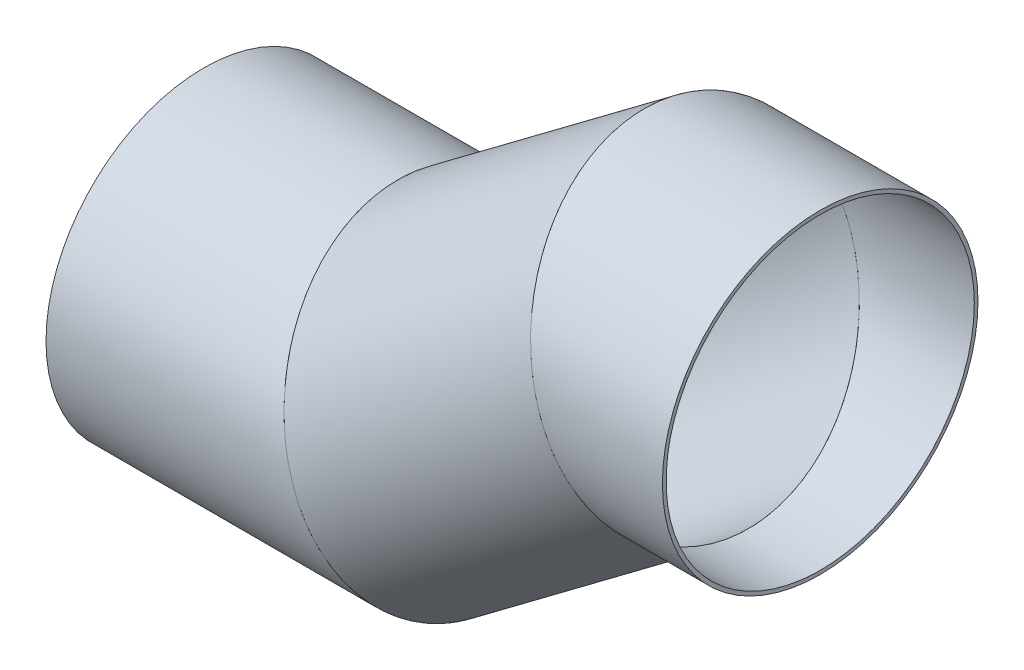
ISO-10303-21;
HEADER;
FILE_DESCRIPTION(('STEP AP214'),'2;1');
FILE_NAME('part.step','',(''),(''),'','','');
FILE_SCHEMA(('AUTOMOTIVE_DESIGN { 1 0 10303 214 1 1 1 1 }'));
ENDSEC;
DATA;
#1=APPLICATION_CONTEXT('core data for automotive mechanical design processes');
#2=APPLICATION_PROTOCOL_DEFINITION('international standard','automotive_design',2000,#1);
#3=PRODUCT_CONTEXT('',#1,'mechanical');
#4=PRODUCT('Part','Part','',(#3));
#5=PRODUCT_RELATED_PRODUCT_CATEGORY('part','',(#4));
#6=PRODUCT_DEFINITION_FORMATION('','',#4);
#7=PRODUCT_DEFINITION_CONTEXT('part definition',#1,'design');
#8=PRODUCT_DEFINITION('design','',#6,#7);
#9=PRODUCT_DEFINITION_SHAPE('','',#8);
#10=(LENGTH_UNIT() NAMED_UNIT(*) SI_UNIT(.MILLI.,.METRE.));
#11=(NAMED_UNIT(*) PLANE_ANGLE_UNIT() SI_UNIT($,.RADIAN.));
#12=(NAMED_UNIT(*) SI_UNIT($,.STERADIAN.) SOLID_ANGLE_UNIT());
#13=UNCERTAINTY_MEASURE_WITH_UNIT(LENGTH_MEASURE(1.E-05),#10,'distance_accuracy_value','');
#14=(GEOMETRIC_REPRESENTATION_CONTEXT(3) GLOBAL_UNCERTAINTY_ASSIGNED_CONTEXT((#13)) GLOBAL_UNIT_ASSIGNED_CONTEXT((#10,
#11,#12)) REPRESENTATION_CONTEXT('',''));
#15=CARTESIAN_POINT('',(0.,0.,0.));
#16=DIRECTION('',(0.,0.,1.));
#17=DIRECTION('',(1.,0.,0.));
#18=AXIS2_PLACEMENT_3D('',#15,#16,#17);
#19=CARTESIAN_POINT('',(200.,0.,0.));
#20=DIRECTION('',(-1.,0.,0.));
#21=DIRECTION('',(0.,0.,1.));
#22=AXIS2_PLACEMENT_3D('',#19,#20,#21);
#23=CYLINDRICAL_SURFACE('',#22,125.);
#24=CARTESIAN_POINT('',(0.,0.,0.));
#25=DIRECTION('',(1.,0.,0.));
#26=DIRECTION('',(0.,0.,-1.));
#27=AXIS2_PLACEMENT_3D('',#24,#25,#26);
#28=CIRCLE('',#27,125.);
#29=CARTESIAN_POINT('',(0.,0.,-125.));
#30=VERTEX_POINT('',#29);
#31=EDGE_CURVE('E57',#30,#30,#28,.T.);
#32=ORIENTED_EDGE('',*,*,#31,.F.);
#33=EDGE_LOOP('',(#32));
#34=FACE_BOUND('',#33,.T.);
#35=CARTESIAN_POINT('',(200.,0.,0.));
#36=DIRECTION('',(0.948683298050514,0.316227766016838,0.));
#37=DIRECTION('',(-0.316227766016838,0.948683298050514,0.));
#38=AXIS2_PLACEMENT_3D('',#35,#36,#37);
#39=ELLIPSE('',#38,131.761569173682,125.);
#40=CARTESIAN_POINT('',(158.333333333333,125.,0.));
#41=VERTEX_POINT('',#40);
#42=EDGE_CURVE('E53',#41,#41,#39,.T.);
#43=ORIENTED_EDGE('',*,*,#42,.T.);
#44=EDGE_LOOP('',(#43));
#45=FACE_BOUND('',#44,.T.);
#46=ADVANCED_FACE('F49',(#34,#45),#23,.F.);
#47=CARTESIAN_POINT('',(200.,0.,0.));
#48=DIRECTION('',(-1.,0.,0.));
#49=DIRECTION('',(0.,0.,1.));
#50=AXIS2_PLACEMENT_3D('',#47,#48,#49);
#51=CYLINDRICAL_SURFACE('',#50,128.);
#52=CARTESIAN_POINT('',(0.,0.,0.));
#53=DIRECTION('',(1.,0.,0.));
#54=DIRECTION('',(0.,0.,-1.));
#55=AXIS2_PLACEMENT_3D('',#52,#53,#54);
#56=CIRCLE('',#55,128.);
#57=CARTESIAN_POINT('',(0.,0.,-128.));
#58=VERTEX_POINT('',#57);
#59=EDGE_CURVE('E61',#58,#58,#56,.T.);
#60=ORIENTED_EDGE('',*,*,#59,.T.);
#61=EDGE_LOOP('',(#60));
#62=FACE_BOUND('',#61,.T.);
#63=CARTESIAN_POINT('',(200.,0.,0.));
#64=DIRECTION('',(0.948683298050514,0.316227766016838,0.));
#65=DIRECTION('',(-0.316227766016838,0.948683298050514,0.));
#66=AXIS2_PLACEMENT_3D('',#63,#64,#65);
#67=ELLIPSE('',#66,134.923846833851,128.);
#68=CARTESIAN_POINT('',(157.333333333333,128.,0.));
#69=VERTEX_POINT('',#68);
#70=EDGE_CURVE('E12',#69,#69,#67,.T.);
#71=ORIENTED_EDGE('',*,*,#70,.F.);
#72=EDGE_LOOP('',(#71));
#73=FACE_BOUND('',#72,.T.);
#74=ADVANCED_FACE('F76',(#62,#73),#51,.T.);
#75=CARTESIAN_POINT('',(0.,0.,0.));
#76=DIRECTION('',(1.,0.,0.));
#77=DIRECTION('',(0.,0.,-1.));
#78=AXIS2_PLACEMENT_3D('',#75,#76,#77);
#79=PLANE('',#78);
#80=ORIENTED_EDGE('',*,*,#31,.T.);
#81=EDGE_LOOP('',(#80));
#82=FACE_BOUND('',#81,.T.);
#83=ORIENTED_EDGE('',*,*,#59,.F.);
#84=EDGE_LOOP('',(#83));
#85=FACE_BOUND('',#84,.T.);
#86=ADVANCED_FACE('F72',(#82,#85),#79,.F.);
#87=CARTESIAN_POINT('',(200.,0.,0.));
#88=DIRECTION('',(0.948683298050514,0.316227766016838,0.));
#89=DIRECTION('',(-0.316227766016838,0.948683298050514,0.));
#90=AXIS2_PLACEMENT_3D('',#87,#88,#89);
#91=PLANE('',#90);
#92=ORIENTED_EDGE('',*,*,#42,.F.);
#93=EDGE_LOOP('',(#92));
#94=FACE_BOUND('',#93,.T.);
#95=ORIENTED_EDGE('',*,*,#70,.T.);
#96=EDGE_LOOP('',(#95));
#97=FACE_BOUND('',#96,.T.);
#98=ADVANCED_FACE('F51',(#94,#97),#91,.T.);
#99=CLOSED_SHELL('',(#46,#74,#86,#98));
#100=MANIFOLD_SOLID_BREP('B2',#99);
#101=CARTESIAN_POINT('',(400.,150.,0.));
#102=DIRECTION('',(-0.8,-0.6,0.));
#103=DIRECTION('',(0.6,-0.8,0.));
#104=AXIS2_PLACEMENT_3D('',#101,#102,#103);
#105=CYLINDRICAL_SURFACE('',#104,125.);
#106=CARTESIAN_POINT('',(400.,150.,0.));
#107=DIRECTION('',(0.948683298050514,0.316227766016838,0.));
#108=DIRECTION('',(0.316227766016838,-0.948683298050514,0.));
#109=AXIS2_PLACEMENT_3D('',#106,#107,#108);
#110=ELLIPSE('',#109,131.761569173682,125.);
#111=CARTESIAN_POINT('',(441.666666666667,25.,0.));
#112=VERTEX_POINT('',#111);
#113=EDGE_CURVE('E154',#112,#112,#110,.T.);
#114=ORIENTED_EDGE('',*,*,#113,.T.);
#115=EDGE_LOOP('',(#114));
#116=FACE_BOUND('',#115,.T.);
#117=CARTESIAN_POINT('',(200.,0.,0.));
#118=DIRECTION('',(-0.948683298050514,-0.316227766016838,0.));
#119=DIRECTION('',(0.316227766016838,-0.948683298050514,0.));
#120=AXIS2_PLACEMENT_3D('',#117,#118,#119);
#121=ELLIPSE('',#120,131.761569173682,125.);
#122=CARTESIAN_POINT('',(241.666666666667,-125.,0.));
#123=VERTEX_POINT('',#122);
#124=EDGE_CURVE('E144',#123,#123,#121,.T.);
#125=ORIENTED_EDGE('',*,*,#124,.T.);
#126=EDGE_LOOP('',(#125));
#127=FACE_BOUND('',#126,.T.);
#128=ADVANCED_FACE('F140',(#116,#127),#105,.F.);
#129=CARTESIAN_POINT('',(400.,150.,0.));
#130=DIRECTION('',(-0.8,-0.6,0.));
#131=DIRECTION('',(0.6,-0.8,0.));
#132=AXIS2_PLACEMENT_3D('',#129,#130,#131);
#133=CYLINDRICAL_SURFACE('',#132,128.);
#134=CARTESIAN_POINT('',(400.,150.,0.));
#135=DIRECTION('',(0.948683298050514,0.316227766016838,0.));
#136=DIRECTION('',(0.316227766016838,-0.948683298050514,0.));
#137=AXIS2_PLACEMENT_3D('',#134,#135,#136);
#138=ELLIPSE('',#137,134.923846833851,128.);
#139=CARTESIAN_POINT('',(442.666666666667,22.,0.));
#140=VERTEX_POINT('',#139);
#141=EDGE_CURVE('E148',#140,#140,#138,.T.);
#142=ORIENTED_EDGE('',*,*,#141,.F.);
#143=EDGE_LOOP('',(#142));
#144=FACE_BOUND('',#143,.T.);
#145=CARTESIAN_POINT('',(200.,0.,0.));
#146=DIRECTION('',(-0.948683298050514,-0.316227766016838,0.));
#147=DIRECTION('',(0.316227766016838,-0.948683298050514,0.));
#148=AXIS2_PLACEMENT_3D('',#145,#146,#147);
#149=ELLIPSE('',#148,134.923846833851,128.);
#150=CARTESIAN_POINT('',(242.666666666667,-128.,0.));
#151=VERTEX_POINT('',#150);
#152=EDGE_CURVE('E48',#151,#151,#149,.T.);
#153=ORIENTED_EDGE('',*,*,#152,.F.);
#154=EDGE_LOOP('',(#153));
#155=FACE_BOUND('',#154,.T.);
#156=ADVANCED_FACE('F167',(#144,#155),#133,.T.);
#157=CARTESIAN_POINT('',(400.,150.,0.));
#158=DIRECTION('',(0.948683298050514,0.316227766016838,0.));
#159=DIRECTION('',(-0.316227766016838,0.948683298050514,0.));
#160=AXIS2_PLACEMENT_3D('',#157,#158,#159);
#161=PLANE('',#160);
#162=ORIENTED_EDGE('',*,*,#113,.F.);
#163=EDGE_LOOP('',(#162));
#164=FACE_BOUND('',#163,.T.);
#165=ORIENTED_EDGE('',*,*,#141,.T.);
#166=EDGE_LOOP('',(#165));
#167=FACE_BOUND('',#166,.T.);
#168=ADVANCED_FACE('F163',(#164,#167),#161,.T.);
#169=CARTESIAN_POINT('',(200.,0.,0.));
#170=DIRECTION('',(-0.948683298050514,-0.316227766016838,0.));
#171=DIRECTION('',(0.316227766016838,-0.948683298050514,0.));
#172=AXIS2_PLACEMENT_3D('',#169,#170,#171);
#173=PLANE('',#172);
#174=ORIENTED_EDGE('',*,*,#124,.F.);
#175=EDGE_LOOP('',(#174));
#176=FACE_BOUND('',#175,.T.);
#177=ORIENTED_EDGE('',*,*,#152,.T.);
#178=EDGE_LOOP('',(#177));
#179=FACE_BOUND('',#178,.T.);
#180=ADVANCED_FACE('F142',(#176,#179),#173,.T.);
#181=CLOSED_SHELL('',(#128,#156,#168,#180));
#182=MANIFOLD_SOLID_BREP('B7',#181);
#183=CARTESIAN_POINT('',(500.,150.,0.));
#184=DIRECTION('',(-1.,0.,0.));
#185=DIRECTION('',(0.,-1.,0.));
#186=AXIS2_PLACEMENT_3D('',#183,#184,#185);
#187=CYLINDRICAL_SURFACE('',#186,125.);
#188=CARTESIAN_POINT('',(500.,150.,0.));
#189=DIRECTION('',(1.,0.,0.));
#190=DIRECTION('',(0.,0.,-1.));
#191=AXIS2_PLACEMENT_3D('',#188,#189,#190);
#192=CIRCLE('',#191,125.);
#193=CARTESIAN_POINT('',(500.,150.,-125.));
#194=VERTEX_POINT('',#193);
#195=EDGE_CURVE('E240',#194,#194,#192,.T.);
#196=ORIENTED_EDGE('',*,*,#195,.T.);
#197=EDGE_LOOP('',(#196));
#198=FACE_BOUND('',#197,.T.);
#199=CARTESIAN_POINT('',(400.,150.,0.));
#200=DIRECTION('',(-0.948683298050514,-0.316227766016838,0.));
#201=DIRECTION('',(-0.316227766016838,0.948683298050514,0.));
#202=AXIS2_PLACEMENT_3D('',#199,#200,#201);
#203=ELLIPSE('',#202,131.761569173682,125.);
#204=CARTESIAN_POINT('',(358.333333333333,275.,0.));
#205=VERTEX_POINT('',#204);
#206=EDGE_CURVE('E230',#205,#205,#203,.T.);
#207=ORIENTED_EDGE('',*,*,#206,.T.);
#208=EDGE_LOOP('',(#207));
#209=FACE_BOUND('',#208,.T.);
#210=ADVANCED_FACE('F226',(#198,#209),#187,.F.);
#211=CARTESIAN_POINT('',(500.,150.,0.));
#212=DIRECTION('',(-1.,0.,0.));
#213=DIRECTION('',(0.,-1.,0.));
#214=AXIS2_PLACEMENT_3D('',#211,#212,#213);
#215=CYLINDRICAL_SURFACE('',#214,128.);
#216=CARTESIAN_POINT('',(500.,150.,0.));
#217=DIRECTION('',(1.,0.,0.));
#218=DIRECTION('',(0.,0.,-1.));
#219=AXIS2_PLACEMENT_3D('',#216,#217,#218);
#220=CIRCLE('',#219,128.);
#221=CARTESIAN_POINT('',(500.,150.,-128.));
#222=VERTEX_POINT('',#221);
#223=EDGE_CURVE('E234',#222,#222,#220,.T.);
#224=ORIENTED_EDGE('',*,*,#223,.F.);
#225=EDGE_LOOP('',(#224));
#226=FACE_BOUND('',#225,.T.);
#227=CARTESIAN_POINT('',(400.,150.,0.));
#228=DIRECTION('',(-0.948683298050514,-0.316227766016838,0.));
#229=DIRECTION('',(-0.316227766016838,0.948683298050514,0.));
#230=AXIS2_PLACEMENT_3D('',#227,#228,#229);
#231=ELLIPSE('',#230,134.923846833851,128.);
#232=CARTESIAN_POINT('',(357.333333333333,278.,0.));
#233=VERTEX_POINT('',#232);
#234=EDGE_CURVE('E139',#233,#233,#231,.T.);
#235=ORIENTED_EDGE('',*,*,#234,.F.);
#236=EDGE_LOOP('',(#235));
#237=FACE_BOUND('',#236,.T.);
#238=ADVANCED_FACE('F253',(#226,#237),#215,.T.);
#239=CARTESIAN_POINT('',(500.,150.,0.));
#240=DIRECTION('',(1.,0.,0.));
#241=DIRECTION('',(0.,0.,-1.));
#242=AXIS2_PLACEMENT_3D('',#239,#240,#241);
#243=PLANE('',#242);
#244=ORIENTED_EDGE('',*,*,#195,.F.);
#245=EDGE_LOOP('',(#244));
#246=FACE_BOUND('',#245,.T.);
#247=ORIENTED_EDGE('',*,*,#223,.T.);
#248=EDGE_LOOP('',(#247));
#249=FACE_BOUND('',#248,.T.);
#250=ADVANCED_FACE('F249',(#246,#249),#243,.T.);
#251=CARTESIAN_POINT('',(400.,150.,0.));
#252=DIRECTION('',(-0.948683298050514,-0.316227766016838,0.));
#253=DIRECTION('',(0.316227766016838,-0.948683298050514,0.));
#254=AXIS2_PLACEMENT_3D('',#251,#252,#253);
#255=PLANE('',#254);
#256=ORIENTED_EDGE('',*,*,#206,.F.);
#257=EDGE_LOOP('',(#256));
#258=FACE_BOUND('',#257,.T.);
#259=ORIENTED_EDGE('',*,*,#234,.T.);
#260=EDGE_LOOP('',(#259));
#261=FACE_BOUND('',#260,.T.);
#262=ADVANCED_FACE('F228',(#258,#261),#255,.T.);
#263=CLOSED_SHELL('',(#210,#238,#250,#262));
#264=MANIFOLD_SOLID_BREP('B43',#263);
#265=ADVANCED_BREP_SHAPE_REPRESENTATION('',(#18,#100,#182,#264),#14);
#266=SHAPE_DEFINITION_REPRESENTATION(#9,#265);
ENDSEC;
END-ISO-10303-21;
